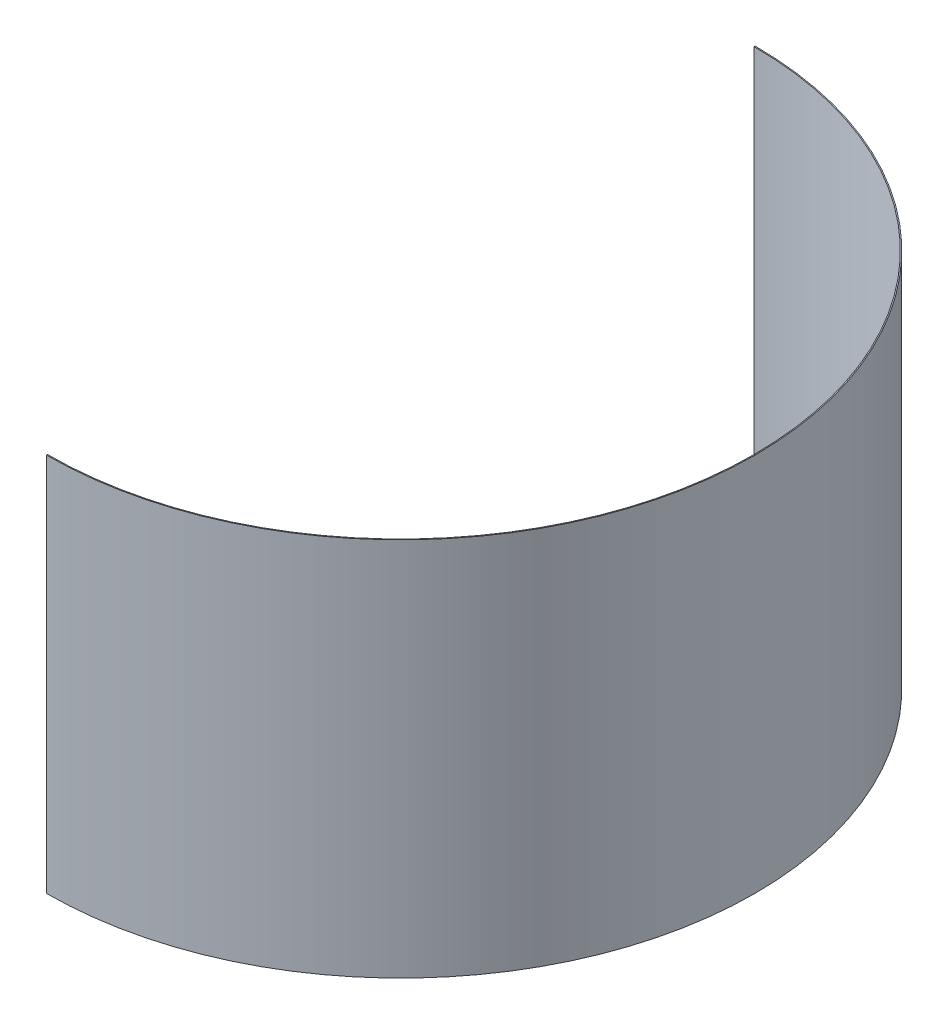
ISO-10303-21;
HEADER;
FILE_DESCRIPTION(('STEP AP214'),'2;1');
FILE_NAME('part.step','',(''),(''),'','','');
FILE_SCHEMA(('AUTOMOTIVE_DESIGN { 1 0 10303 214 1 1 1 1 }'));
ENDSEC;
DATA;
#1=APPLICATION_CONTEXT('core data for automotive mechanical design processes');
#2=APPLICATION_PROTOCOL_DEFINITION('international standard','automotive_design',2000,#1);
#3=PRODUCT_CONTEXT('',#1,'mechanical');
#4=PRODUCT('Part','Part','',(#3));
#5=PRODUCT_RELATED_PRODUCT_CATEGORY('part','',(#4));
#6=PRODUCT_DEFINITION_FORMATION('','',#4);
#7=PRODUCT_DEFINITION_CONTEXT('part definition',#1,'design');
#8=PRODUCT_DEFINITION('design','',#6,#7);
#9=PRODUCT_DEFINITION_SHAPE('','',#8);
#10=(LENGTH_UNIT() NAMED_UNIT(*) SI_UNIT(.MILLI.,.METRE.));
#11=(NAMED_UNIT(*) PLANE_ANGLE_UNIT() SI_UNIT($,.RADIAN.));
#12=(NAMED_UNIT(*) SI_UNIT($,.STERADIAN.) SOLID_ANGLE_UNIT());
#13=UNCERTAINTY_MEASURE_WITH_UNIT(LENGTH_MEASURE(1.E-05),#10,'distance_accuracy_value','');
#14=(GEOMETRIC_REPRESENTATION_CONTEXT(3) GLOBAL_UNCERTAINTY_ASSIGNED_CONTEXT((#13)) GLOBAL_UNIT_ASSIGNED_CONTEXT((#10,
#11,#12)) REPRESENTATION_CONTEXT('',''));
#15=CARTESIAN_POINT('',(0.,0.,0.));
#16=DIRECTION('',(0.,0.,1.));
#17=DIRECTION('',(1.,0.,0.));
#18=AXIS2_PLACEMENT_3D('',#15,#16,#17);
#19=CARTESIAN_POINT('',(0.,2399.99999999999,0.));
#20=DIRECTION('',(0.,1.,0.));
#21=DIRECTION('',(0.,0.,1.));
#22=AXIS2_PLACEMENT_3D('',#19,#20,#21);
#23=CYLINDRICAL_SURFACE('',#22,700.);
#24=CARTESIAN_POINT('',(0.,3149.99999999999,0.));
#25=DIRECTION('',(0.,1.,0.));
#26=DIRECTION('',(0.,0.,1.));
#27=AXIS2_PLACEMENT_3D('',#24,#25,#26);
#28=CIRCLE('',#27,700.);
#29=CARTESIAN_POINT('',(0.,3149.99999999999,700.));
#30=VERTEX_POINT('',#29);
#31=CARTESIAN_POINT('',(0.,3149.99999999999,-700.));
#32=VERTEX_POINT('',#31);
#33=EDGE_CURVE('E106',#30,#32,#28,.T.);
#34=ORIENTED_EDGE('',*,*,#33,.F.);
#35=DIRECTION('',(0.,1.,0.));
#36=VECTOR('',#35,1.);
#37=CARTESIAN_POINT('',(0.,2399.99999999999,700.));
#38=LINE('',#37,#36);
#39=CARTESIAN_POINT('',(0.,2399.99999999999,700.));
#40=VERTEX_POINT('',#39);
#41=EDGE_CURVE('E11',#40,#30,#38,.T.);
#42=ORIENTED_EDGE('',*,*,#41,.F.);
#43=CARTESIAN_POINT('',(0.,2399.99999999999,0.));
#44=DIRECTION('',(0.,1.,0.));
#45=DIRECTION('',(0.,0.,1.));
#46=AXIS2_PLACEMENT_3D('',#43,#44,#45);
#47=CIRCLE('',#46,700.);
#48=CARTESIAN_POINT('',(0.,2399.99999999999,-700.));
#49=VERTEX_POINT('',#48);
#50=EDGE_CURVE('E101',#40,#49,#47,.T.);
#51=ORIENTED_EDGE('',*,*,#50,.T.);
#52=DIRECTION('',(0.,1.,0.));
#53=VECTOR('',#52,1.);
#54=CARTESIAN_POINT('',(0.,2399.99999999999,-700.));
#55=LINE('',#54,#53);
#56=EDGE_CURVE('E44',#49,#32,#55,.T.);
#57=ORIENTED_EDGE('',*,*,#56,.T.);
#58=EDGE_LOOP('',(#34,#42,#51,#57));
#59=FACE_BOUND('',#58,.T.);
#60=ADVANCED_FACE('F41',(#59),#23,.T.);
#61=CARTESIAN_POINT('',(0.,2399.99999999999,700.));
#62=DIRECTION('',(1.,0.,0.));
#63=DIRECTION('',(0.,0.,-1.));
#64=AXIS2_PLACEMENT_3D('',#61,#62,#63);
#65=PLANE('',#64);
#66=DIRECTION('',(0.,0.,-1.));
#67=VECTOR('',#66,1.);
#68=CARTESIAN_POINT('',(0.,3149.99999999999,700.));
#69=LINE('',#68,#67);
#70=CARTESIAN_POINT('',(-1.28220519870728E-13,3149.99999999999,698.));
#71=VERTEX_POINT('',#70);
#72=EDGE_CURVE('E74',#30,#71,#69,.T.);
#73=ORIENTED_EDGE('',*,*,#72,.T.);
#74=DIRECTION('',(0.,1.,0.));
#75=VECTOR('',#74,1.);
#76=CARTESIAN_POINT('',(-1.28220519870728E-13,2399.99999999999,698.));
#77=LINE('',#76,#75);
#78=CARTESIAN_POINT('',(-1.28220519870728E-13,2399.99999999999,698.));
#79=VERTEX_POINT('',#78);
#80=EDGE_CURVE('E50',#79,#71,#77,.T.);
#81=ORIENTED_EDGE('',*,*,#80,.F.);
#82=DIRECTION('',(0.,0.,-1.));
#83=VECTOR('',#82,1.);
#84=CARTESIAN_POINT('',(0.,2399.99999999999,700.));
#85=LINE('',#84,#83);
#86=EDGE_CURVE('E89',#40,#79,#85,.T.);
#87=ORIENTED_EDGE('',*,*,#86,.F.);
#88=ORIENTED_EDGE('',*,*,#41,.T.);
#89=EDGE_LOOP('',(#73,#81,#87,#88));
#90=FACE_BOUND('',#89,.T.);
#91=ADVANCED_FACE('F116',(#90),#65,.F.);
#92=CARTESIAN_POINT('',(0.,2399.99999999999,0.));
#93=DIRECTION('',(0.,1.,0.));
#94=DIRECTION('',(0.,0.,1.));
#95=AXIS2_PLACEMENT_3D('',#92,#93,#94);
#96=CYLINDRICAL_SURFACE('',#95,698.);
#97=CARTESIAN_POINT('',(0.,3149.99999999999,0.));
#98=DIRECTION('',(0.,1.,0.));
#99=DIRECTION('',(1.,0.,0.));
#100=AXIS2_PLACEMENT_3D('',#97,#98,#99);
#101=CIRCLE('',#100,698.);
#102=CARTESIAN_POINT('',(0.,3149.99999999999,-698.));
#103=VERTEX_POINT('',#102);
#104=EDGE_CURVE('E96',#71,#103,#101,.T.);
#105=ORIENTED_EDGE('',*,*,#104,.T.);
#106=DIRECTION('',(0.,1.,0.));
#107=VECTOR('',#106,1.);
#108=CARTESIAN_POINT('',(0.,2399.99999999999,-698.));
#109=LINE('',#108,#107);
#110=CARTESIAN_POINT('',(0.,2399.99999999999,-698.));
#111=VERTEX_POINT('',#110);
#112=EDGE_CURVE('E93',#111,#103,#109,.T.);
#113=ORIENTED_EDGE('',*,*,#112,.F.);
#114=CARTESIAN_POINT('',(0.,2399.99999999999,0.));
#115=DIRECTION('',(0.,1.,0.));
#116=DIRECTION('',(1.,0.,0.));
#117=AXIS2_PLACEMENT_3D('',#114,#115,#116);
#118=CIRCLE('',#117,698.);
#119=EDGE_CURVE('E86',#79,#111,#118,.T.);
#120=ORIENTED_EDGE('',*,*,#119,.F.);
#121=ORIENTED_EDGE('',*,*,#80,.T.);
#122=EDGE_LOOP('',(#105,#113,#120,#121));
#123=FACE_BOUND('',#122,.T.);
#124=ADVANCED_FACE('F94',(#123),#96,.F.);
#125=CARTESIAN_POINT('',(0.,2399.99999999999,-698.));
#126=DIRECTION('',(1.,0.,0.));
#127=DIRECTION('',(0.,0.,-1.));
#128=AXIS2_PLACEMENT_3D('',#125,#126,#127);
#129=PLANE('',#128);
#130=DIRECTION('',(0.,0.,-1.));
#131=VECTOR('',#130,1.);
#132=CARTESIAN_POINT('',(0.,3149.99999999999,-698.));
#133=LINE('',#132,#131);
#134=EDGE_CURVE('E109',#103,#32,#133,.T.);
#135=ORIENTED_EDGE('',*,*,#134,.T.);
#136=ORIENTED_EDGE('',*,*,#56,.F.);
#137=DIRECTION('',(0.,0.,-1.));
#138=VECTOR('',#137,1.);
#139=CARTESIAN_POINT('',(0.,2399.99999999999,-698.));
#140=LINE('',#139,#138);
#141=EDGE_CURVE('E83',#111,#49,#140,.T.);
#142=ORIENTED_EDGE('',*,*,#141,.F.);
#143=ORIENTED_EDGE('',*,*,#112,.T.);
#144=EDGE_LOOP('',(#135,#136,#142,#143));
#145=FACE_BOUND('',#144,.T.);
#146=ADVANCED_FACE('F100',(#145),#129,.F.);
#147=CARTESIAN_POINT('',(0.,2399.99999999999,0.));
#148=DIRECTION('',(0.,1.,0.));
#149=DIRECTION('',(1.,0.,0.));
#150=AXIS2_PLACEMENT_3D('',#147,#148,#149);
#151=PLANE('',#150);
#152=ORIENTED_EDGE('',*,*,#50,.F.);
#153=ORIENTED_EDGE('',*,*,#86,.T.);
#154=ORIENTED_EDGE('',*,*,#119,.T.);
#155=ORIENTED_EDGE('',*,*,#141,.T.);
#156=EDGE_LOOP('',(#152,#153,#154,#155));
#157=FACE_BOUND('',#156,.T.);
#158=ADVANCED_FACE('F88',(#157),#151,.F.);
#159=CARTESIAN_POINT('',(0.,3149.99999999999,0.));
#160=DIRECTION('',(0.,1.,0.));
#161=DIRECTION('',(1.,0.,0.));
#162=AXIS2_PLACEMENT_3D('',#159,#160,#161);
#163=PLANE('',#162);
#164=ORIENTED_EDGE('',*,*,#33,.T.);
#165=ORIENTED_EDGE('',*,*,#134,.F.);
#166=ORIENTED_EDGE('',*,*,#104,.F.);
#167=ORIENTED_EDGE('',*,*,#72,.F.);
#168=EDGE_LOOP('',(#164,#165,#166,#167));
#169=FACE_BOUND('',#168,.T.);
#170=ADVANCED_FACE('F114',(#169),#163,.T.);
#171=CLOSED_SHELL('',(#60,#91,#124,#146,#158,#170));
#172=MANIFOLD_SOLID_BREP('B2',#171);
#173=ADVANCED_BREP_SHAPE_REPRESENTATION('',(#18,#172),#14);
#174=SHAPE_DEFINITION_REPRESENTATION(#9,#173);
ENDSEC;
END-ISO-10303-21;
